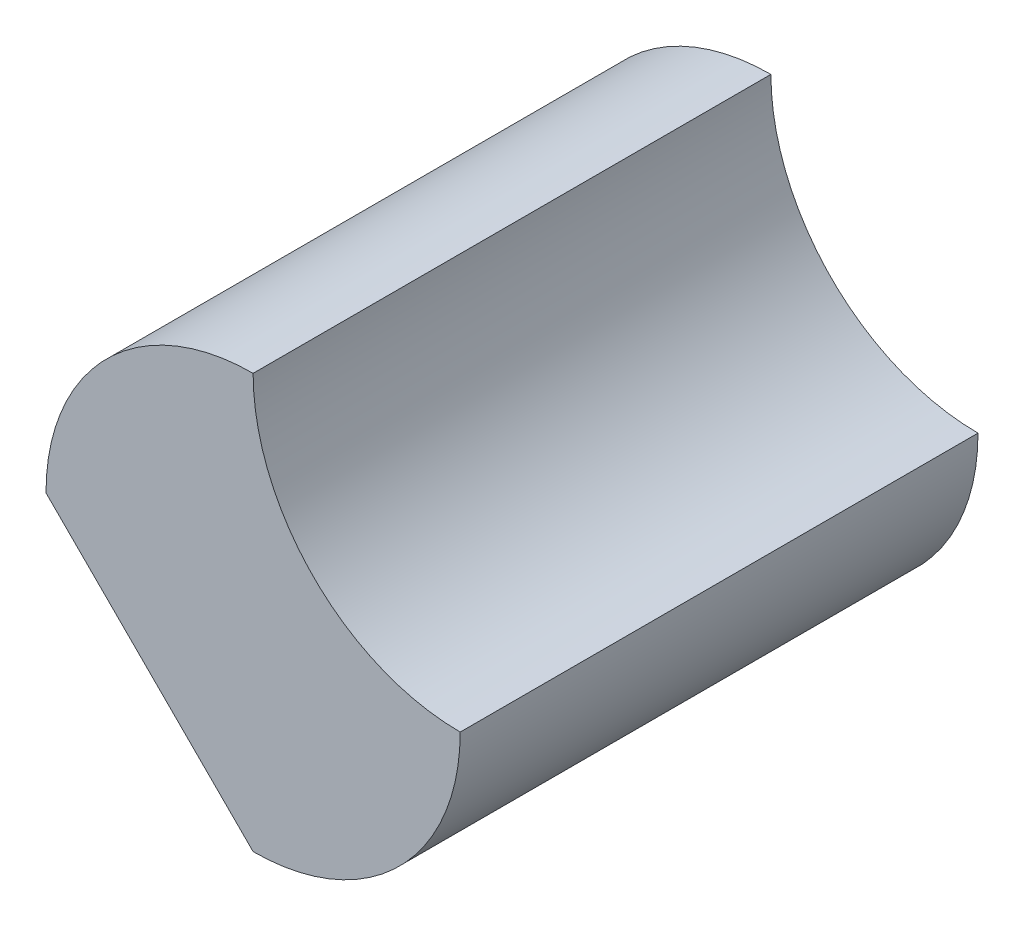
ISO-10303-21;
HEADER;
FILE_DESCRIPTION(('STEP AP214'),'2;1');
FILE_NAME('part.step','',(''),(''),'','','');
FILE_SCHEMA(('AUTOMOTIVE_DESIGN { 1 0 10303 214 1 1 1 1 }'));
ENDSEC;
DATA;
#1=APPLICATION_CONTEXT('core data for automotive mechanical design processes');
#2=APPLICATION_PROTOCOL_DEFINITION('international standard','automotive_design',2000,#1);
#3=PRODUCT_CONTEXT('',#1,'mechanical');
#4=PRODUCT('Part','Part','',(#3));
#5=PRODUCT_RELATED_PRODUCT_CATEGORY('part','',(#4));
#6=PRODUCT_DEFINITION_FORMATION('','',#4);
#7=PRODUCT_DEFINITION_CONTEXT('part definition',#1,'design');
#8=PRODUCT_DEFINITION('design','',#6,#7);
#9=PRODUCT_DEFINITION_SHAPE('','',#8);
#10=(LENGTH_UNIT() NAMED_UNIT(*) SI_UNIT(.MILLI.,.METRE.));
#11=(NAMED_UNIT(*) PLANE_ANGLE_UNIT() SI_UNIT($,.RADIAN.));
#12=(NAMED_UNIT(*) SI_UNIT($,.STERADIAN.) SOLID_ANGLE_UNIT());
#13=UNCERTAINTY_MEASURE_WITH_UNIT(LENGTH_MEASURE(1.E-05),#10,'distance_accuracy_value','');
#14=(GEOMETRIC_REPRESENTATION_CONTEXT(3) GLOBAL_UNCERTAINTY_ASSIGNED_CONTEXT((#13)) GLOBAL_UNIT_ASSIGNED_CONTEXT((#10,
#11,#12)) REPRESENTATION_CONTEXT('',''));
#15=CARTESIAN_POINT('',(0.,0.,0.));
#16=DIRECTION('',(0.,0.,1.));
#17=DIRECTION('',(1.,0.,0.));
#18=AXIS2_PLACEMENT_3D('',#15,#16,#17);
#19=CARTESIAN_POINT('',(0.,10.,25.));
#20=DIRECTION('',(0.,0.,-1.));
#21=DIRECTION('',(-1.,0.,0.));
#22=AXIS2_PLACEMENT_3D('',#19,#20,#21);
#23=CYLINDRICAL_SURFACE('',#22,10.);
#24=CARTESIAN_POINT('',(0.,10.,0.));
#25=DIRECTION('',(0.,0.,1.));
#26=DIRECTION('',(-1.,0.,0.));
#27=AXIS2_PLACEMENT_3D('',#24,#25,#26);
#28=CIRCLE('',#27,10.);
#29=CARTESIAN_POINT('',(0.,20.,0.));
#30=VERTEX_POINT('',#29);
#31=CARTESIAN_POINT('',(-10.,10.,0.));
#32=VERTEX_POINT('',#31);
#33=EDGE_CURVE('E96',#30,#32,#28,.T.);
#34=ORIENTED_EDGE('',*,*,#33,.T.);
#35=DIRECTION('',(0.,0.,-1.));
#36=VECTOR('',#35,1.);
#37=CARTESIAN_POINT('',(-10.,10.,25.));
#38=LINE('',#37,#36);
#39=CARTESIAN_POINT('',(-10.,10.,25.));
#40=VERTEX_POINT('',#39);
#41=EDGE_CURVE('E11',#40,#32,#38,.T.);
#42=ORIENTED_EDGE('',*,*,#41,.F.);
#43=CARTESIAN_POINT('',(0.,10.,25.));
#44=DIRECTION('',(0.,0.,1.));
#45=DIRECTION('',(-1.,0.,0.));
#46=AXIS2_PLACEMENT_3D('',#43,#44,#45);
#47=CIRCLE('',#46,10.);
#48=CARTESIAN_POINT('',(0.,20.,25.));
#49=VERTEX_POINT('',#48);
#50=EDGE_CURVE('E84',#49,#40,#47,.T.);
#51=ORIENTED_EDGE('',*,*,#50,.F.);
#52=DIRECTION('',(0.,0.,-1.));
#53=VECTOR('',#52,1.);
#54=CARTESIAN_POINT('',(0.,20.,25.));
#55=LINE('',#54,#53);
#56=EDGE_CURVE('E92',#49,#30,#55,.T.);
#57=ORIENTED_EDGE('',*,*,#56,.T.);
#58=EDGE_LOOP('',(#34,#42,#51,#57));
#59=FACE_BOUND('',#58,.T.);
#60=ADVANCED_FACE('F33',(#59),#23,.T.);
#61=CARTESIAN_POINT('',(-10.,10.,25.));
#62=DIRECTION('',(0.707106781186548,0.707106781186548,0.));
#63=DIRECTION('',(-0.707106781186548,0.707106781186548,0.));
#64=AXIS2_PLACEMENT_3D('',#61,#62,#63);
#65=PLANE('',#64);
#66=DIRECTION('',(0.707106781186548,-0.707106781186548,0.));
#67=VECTOR('',#66,1.);
#68=CARTESIAN_POINT('',(-10.,10.,0.));
#69=LINE('',#68,#67);
#70=CARTESIAN_POINT('',(0.,0.,0.));
#71=VERTEX_POINT('',#70);
#72=EDGE_CURVE('E88',#32,#71,#69,.T.);
#73=ORIENTED_EDGE('',*,*,#72,.T.);
#74=DIRECTION('',(0.,0.,-1.));
#75=VECTOR('',#74,1.);
#76=CARTESIAN_POINT('',(0.,0.,25.));
#77=LINE('',#76,#75);
#78=CARTESIAN_POINT('',(0.,0.,25.));
#79=VERTEX_POINT('',#78);
#80=EDGE_CURVE('E41',#79,#71,#77,.T.);
#81=ORIENTED_EDGE('',*,*,#80,.F.);
#82=DIRECTION('',(0.707106781186548,-0.707106781186548,0.));
#83=VECTOR('',#82,1.);
#84=CARTESIAN_POINT('',(-10.,10.,25.));
#85=LINE('',#84,#83);
#86=EDGE_CURVE('E79',#40,#79,#85,.T.);
#87=ORIENTED_EDGE('',*,*,#86,.F.);
#88=ORIENTED_EDGE('',*,*,#41,.T.);
#89=EDGE_LOOP('',(#73,#81,#87,#88));
#90=FACE_BOUND('',#89,.T.);
#91=ADVANCED_FACE('F87',(#90),#65,.F.);
#92=CARTESIAN_POINT('',(0.,10.,25.));
#93=DIRECTION('',(0.,0.,-1.));
#94=DIRECTION('',(-1.,0.,0.));
#95=AXIS2_PLACEMENT_3D('',#92,#93,#94);
#96=CYLINDRICAL_SURFACE('',#95,10.);
#97=CARTESIAN_POINT('',(0.,10.,0.));
#98=DIRECTION('',(0.,0.,1.));
#99=DIRECTION('',(1.,0.,0.));
#100=AXIS2_PLACEMENT_3D('',#97,#98,#99);
#101=CIRCLE('',#100,10.);
#102=CARTESIAN_POINT('',(9.99999999999999,10.,0.));
#103=VERTEX_POINT('',#102);
#104=EDGE_CURVE('E66',#71,#103,#101,.T.);
#105=ORIENTED_EDGE('',*,*,#104,.T.);
#106=DIRECTION('',(0.,0.,-1.));
#107=VECTOR('',#106,1.);
#108=CARTESIAN_POINT('',(9.99999999999999,10.,25.));
#109=LINE('',#108,#107);
#110=CARTESIAN_POINT('',(9.99999999999999,10.,25.));
#111=VERTEX_POINT('',#110);
#112=EDGE_CURVE('E89',#111,#103,#109,.T.);
#113=ORIENTED_EDGE('',*,*,#112,.F.);
#114=CARTESIAN_POINT('',(0.,10.,25.));
#115=DIRECTION('',(0.,0.,1.));
#116=DIRECTION('',(1.,0.,0.));
#117=AXIS2_PLACEMENT_3D('',#114,#115,#116);
#118=CIRCLE('',#117,10.);
#119=EDGE_CURVE('E82',#79,#111,#118,.T.);
#120=ORIENTED_EDGE('',*,*,#119,.F.);
#121=ORIENTED_EDGE('',*,*,#80,.T.);
#122=EDGE_LOOP('',(#105,#113,#120,#121));
#123=FACE_BOUND('',#122,.T.);
#124=ADVANCED_FACE('F90',(#123),#96,.T.);
#125=CARTESIAN_POINT('',(10.,20.,25.));
#126=DIRECTION('',(0.,0.,-1.));
#127=DIRECTION('',(-1.,0.,0.));
#128=AXIS2_PLACEMENT_3D('',#125,#126,#127);
#129=CYLINDRICAL_SURFACE('',#128,10.);
#130=CARTESIAN_POINT('',(10.,20.,0.));
#131=DIRECTION('',(0.,0.,-1.));
#132=DIRECTION('',(1.,0.,0.));
#133=AXIS2_PLACEMENT_3D('',#130,#131,#132);
#134=CIRCLE('',#133,10.);
#135=EDGE_CURVE('E72',#103,#30,#134,.T.);
#136=ORIENTED_EDGE('',*,*,#135,.T.);
#137=ORIENTED_EDGE('',*,*,#56,.F.);
#138=CARTESIAN_POINT('',(10.,20.,25.));
#139=DIRECTION('',(0.,0.,-1.));
#140=DIRECTION('',(1.,0.,0.));
#141=AXIS2_PLACEMENT_3D('',#138,#139,#140);
#142=CIRCLE('',#141,10.);
#143=EDGE_CURVE('E49',#111,#49,#142,.T.);
#144=ORIENTED_EDGE('',*,*,#143,.F.);
#145=ORIENTED_EDGE('',*,*,#112,.T.);
#146=EDGE_LOOP('',(#136,#137,#144,#145));
#147=FACE_BOUND('',#146,.T.);
#148=ADVANCED_FACE('F103',(#147),#129,.F.);
#149=CARTESIAN_POINT('',(0.,10.,25.));
#150=DIRECTION('',(0.,0.,-1.));
#151=DIRECTION('',(-1.,0.,0.));
#152=AXIS2_PLACEMENT_3D('',#149,#150,#151);
#153=PLANE('',#152);
#154=ORIENTED_EDGE('',*,*,#50,.T.);
#155=ORIENTED_EDGE('',*,*,#86,.T.);
#156=ORIENTED_EDGE('',*,*,#119,.T.);
#157=ORIENTED_EDGE('',*,*,#143,.T.);
#158=EDGE_LOOP('',(#154,#155,#156,#157));
#159=FACE_BOUND('',#158,.T.);
#160=ADVANCED_FACE('F80',(#159),#153,.F.);
#161=CARTESIAN_POINT('',(0.,10.,0.));
#162=DIRECTION('',(0.,0.,-1.));
#163=DIRECTION('',(-1.,0.,0.));
#164=AXIS2_PLACEMENT_3D('',#161,#162,#163);
#165=PLANE('',#164);
#166=ORIENTED_EDGE('',*,*,#33,.F.);
#167=ORIENTED_EDGE('',*,*,#135,.F.);
#168=ORIENTED_EDGE('',*,*,#104,.F.);
#169=ORIENTED_EDGE('',*,*,#72,.F.);
#170=EDGE_LOOP('',(#166,#167,#168,#169));
#171=FACE_BOUND('',#170,.T.);
#172=ADVANCED_FACE('F106',(#171),#165,.T.);
#173=CLOSED_SHELL('',(#60,#91,#124,#148,#160,#172));
#174=MANIFOLD_SOLID_BREP('B2',#173);
#175=ADVANCED_BREP_SHAPE_REPRESENTATION('',(#18,#174),#14);
#176=SHAPE_DEFINITION_REPRESENTATION(#9,#175);
ENDSEC;
END-ISO-10303-21;
